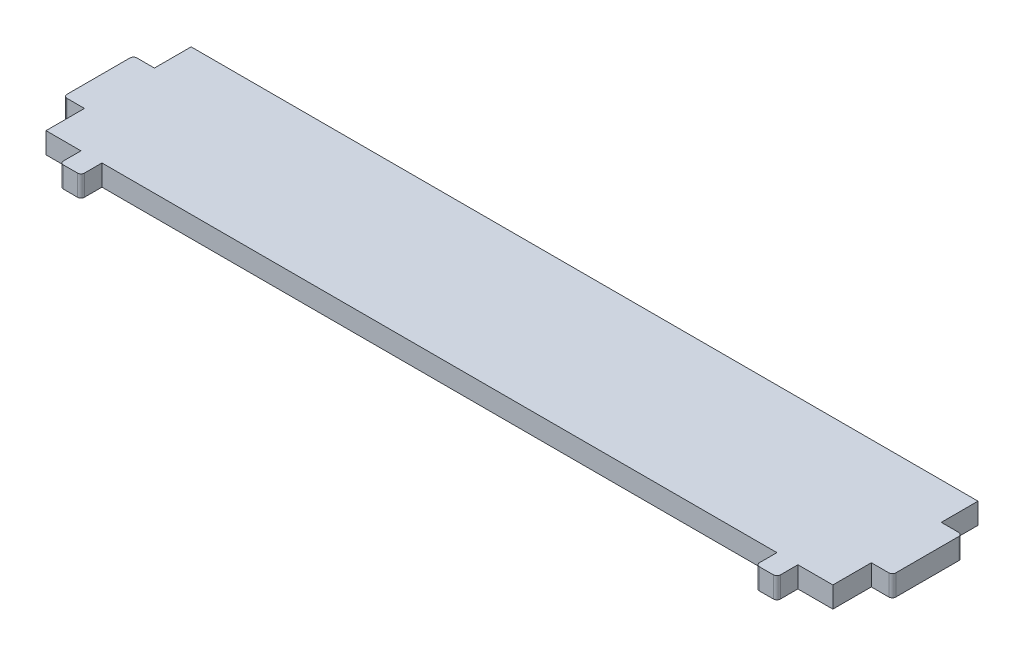
ISO-10303-21;
HEADER;
FILE_DESCRIPTION(('STEP AP214'),'2;1');
FILE_NAME('part.step','',(''),(''),'','','');
FILE_SCHEMA(('AUTOMOTIVE_DESIGN { 1 0 10303 214 1 1 1 1 }'));
ENDSEC;
DATA;
#1=APPLICATION_CONTEXT('core data for automotive mechanical design processes');
#2=APPLICATION_PROTOCOL_DEFINITION('international standard','automotive_design',2000,#1);
#3=PRODUCT_CONTEXT('',#1,'mechanical');
#4=PRODUCT('Part','Part','',(#3));
#5=PRODUCT_RELATED_PRODUCT_CATEGORY('part','',(#4));
#6=PRODUCT_DEFINITION_FORMATION('','',#4);
#7=PRODUCT_DEFINITION_CONTEXT('part definition',#1,'design');
#8=PRODUCT_DEFINITION('design','',#6,#7);
#9=PRODUCT_DEFINITION_SHAPE('','',#8);
#10=(LENGTH_UNIT() NAMED_UNIT(*) SI_UNIT(.MILLI.,.METRE.));
#11=(NAMED_UNIT(*) PLANE_ANGLE_UNIT() SI_UNIT($,.RADIAN.));
#12=(NAMED_UNIT(*) SI_UNIT($,.STERADIAN.) SOLID_ANGLE_UNIT());
#13=UNCERTAINTY_MEASURE_WITH_UNIT(LENGTH_MEASURE(1.E-05),#10,'distance_accuracy_value','');
#14=(GEOMETRIC_REPRESENTATION_CONTEXT(3) GLOBAL_UNCERTAINTY_ASSIGNED_CONTEXT((#13)) GLOBAL_UNIT_ASSIGNED_CONTEXT((#10,
#11,#12)) REPRESENTATION_CONTEXT('',''));
#15=CARTESIAN_POINT('',(0.,0.,0.));
#16=DIRECTION('',(0.,0.,1.));
#17=DIRECTION('',(1.,0.,0.));
#18=AXIS2_PLACEMENT_3D('',#15,#16,#17);
#19=CARTESIAN_POINT('',(-56.25,3.,0.));
#20=DIRECTION('',(-1.,0.,0.));
#21=DIRECTION('',(0.,0.,1.));
#22=AXIS2_PLACEMENT_3D('',#19,#20,#21);
#23=PLANE('',#22);
#24=DIRECTION('',(0.,0.,-1.));
#25=VECTOR('',#24,1.);
#26=CARTESIAN_POINT('',(-56.25,0.,0.));
#27=LINE('',#26,#25);
#28=CARTESIAN_POINT('',(-56.25,0.,20.75));
#29=VERTEX_POINT('',#28);
#30=CARTESIAN_POINT('',(-56.25,0.,15.25));
#31=VERTEX_POINT('',#30);
#32=EDGE_CURVE('E235',#29,#31,#27,.T.);
#33=ORIENTED_EDGE('',*,*,#32,.F.);
#34=DIRECTION('',(0.,-1.,0.));
#35=VECTOR('',#34,1.);
#36=CARTESIAN_POINT('',(-56.25,3.,20.75));
#37=LINE('',#36,#35);
#38=CARTESIAN_POINT('',(-56.25,3.,20.75));
#39=VERTEX_POINT('',#38);
#40=EDGE_CURVE('E230',#39,#29,#37,.T.);
#41=ORIENTED_EDGE('',*,*,#40,.F.);
#42=DIRECTION('',(0.,0.,-1.));
#43=VECTOR('',#42,1.);
#44=CARTESIAN_POINT('',(-56.25,3.,0.));
#45=LINE('',#44,#43);
#46=CARTESIAN_POINT('',(-56.25,3.,15.25));
#47=VERTEX_POINT('',#46);
#48=EDGE_CURVE('E233',#39,#47,#45,.T.);
#49=ORIENTED_EDGE('',*,*,#48,.T.);
#50=DIRECTION('',(0.,-1.,0.));
#51=VECTOR('',#50,1.);
#52=CARTESIAN_POINT('',(-56.25,3.,15.25));
#53=LINE('',#52,#51);
#54=EDGE_CURVE('E315',#47,#31,#53,.T.);
#55=ORIENTED_EDGE('',*,*,#54,.T.);
#56=EDGE_LOOP('',(#33,#41,#49,#55));
#57=FACE_BOUND('',#56,.T.);
#58=ADVANCED_FACE('F43',(#57),#23,.T.);
#59=CARTESIAN_POINT('',(0.,3.,20.75));
#60=DIRECTION('',(0.,0.,-1.));
#61=DIRECTION('',(-1.,0.,0.));
#62=AXIS2_PLACEMENT_3D('',#59,#60,#61);
#63=PLANE('',#62);
#64=DIRECTION('',(1.,0.,0.));
#65=VECTOR('',#64,1.);
#66=CARTESIAN_POINT('',(0.,0.,20.75));
#67=LINE('',#66,#65);
#68=CARTESIAN_POINT('',(-51.25,0.,20.75));
#69=VERTEX_POINT('',#68);
#70=EDGE_CURVE('E318',#29,#69,#67,.T.);
#71=ORIENTED_EDGE('',*,*,#70,.T.);
#72=DIRECTION('',(0.,-1.,0.));
#73=VECTOR('',#72,1.);
#74=CARTESIAN_POINT('',(-51.25,3.,20.75));
#75=LINE('',#74,#73);
#76=CARTESIAN_POINT('',(-51.25,3.,20.75));
#77=VERTEX_POINT('',#76);
#78=EDGE_CURVE('E241',#77,#69,#75,.T.);
#79=ORIENTED_EDGE('',*,*,#78,.F.);
#80=DIRECTION('',(1.,0.,0.));
#81=VECTOR('',#80,1.);
#82=CARTESIAN_POINT('',(0.,3.,20.75));
#83=LINE('',#82,#81);
#84=EDGE_CURVE('E245',#39,#77,#83,.T.);
#85=ORIENTED_EDGE('',*,*,#84,.F.);
#86=ORIENTED_EDGE('',*,*,#40,.T.);
#87=EDGE_LOOP('',(#71,#79,#85,#86));
#88=FACE_BOUND('',#87,.T.);
#89=ADVANCED_FACE('F246',(#88),#63,.F.);
#90=CARTESIAN_POINT('',(-51.25,3.,0.));
#91=DIRECTION('',(-1.,0.,0.));
#92=DIRECTION('',(0.,0.,1.));
#93=AXIS2_PLACEMENT_3D('',#90,#91,#92);
#94=PLANE('',#93);
#95=DIRECTION('',(0.,0.,-1.));
#96=VECTOR('',#95,1.);
#97=CARTESIAN_POINT('',(-51.25,0.,0.));
#98=LINE('',#97,#96);
#99=CARTESIAN_POINT('',(-51.25,0.,23.25));
#100=VERTEX_POINT('',#99);
#101=EDGE_CURVE('E321',#100,#69,#98,.T.);
#102=ORIENTED_EDGE('',*,*,#101,.F.);
#103=DIRECTION('',(0.,-1.,0.));
#104=VECTOR('',#103,1.);
#105=CARTESIAN_POINT('',(-51.25,3.,23.25));
#106=LINE('',#105,#104);
#107=CARTESIAN_POINT('',(-51.25,3.,23.25));
#108=VERTEX_POINT('',#107);
#109=EDGE_CURVE('E443',#100,#108,#106,.F.);
#110=ORIENTED_EDGE('',*,*,#109,.T.);
#111=DIRECTION('',(0.,0.,-1.));
#112=VECTOR('',#111,1.);
#113=CARTESIAN_POINT('',(-51.25,3.,0.));
#114=LINE('',#113,#112);
#115=EDGE_CURVE('E250',#108,#77,#114,.T.);
#116=ORIENTED_EDGE('',*,*,#115,.T.);
#117=ORIENTED_EDGE('',*,*,#78,.T.);
#118=EDGE_LOOP('',(#102,#110,#116,#117));
#119=FACE_BOUND('',#118,.T.);
#120=ADVANCED_FACE('F561',(#119),#94,.T.);
#121=CARTESIAN_POINT('',(0.,3.,23.75));
#122=DIRECTION('',(0.,0.,1.));
#123=DIRECTION('',(1.,0.,0.));
#124=AXIS2_PLACEMENT_3D('',#121,#122,#123);
#125=PLANE('',#124);
#126=DIRECTION('',(-1.,0.,0.));
#127=VECTOR('',#126,1.);
#128=CARTESIAN_POINT('',(0.,3.,23.75));
#129=LINE('',#128,#127);
#130=CARTESIAN_POINT('',(-48.75,3.,23.75));
#131=VERTEX_POINT('',#130);
#132=CARTESIAN_POINT('',(-50.75,3.,23.75));
#133=VERTEX_POINT('',#132);
#134=EDGE_CURVE('E266',#131,#133,#129,.T.);
#135=ORIENTED_EDGE('',*,*,#134,.T.);
#136=DIRECTION('',(0.,-1.,0.));
#137=VECTOR('',#136,1.);
#138=CARTESIAN_POINT('',(-50.75,3.,23.75));
#139=LINE('',#138,#137);
#140=CARTESIAN_POINT('',(-50.75,0.,23.75));
#141=VERTEX_POINT('',#140);
#142=EDGE_CURVE('E415',#133,#141,#139,.T.);
#143=ORIENTED_EDGE('',*,*,#142,.T.);
#144=DIRECTION('',(-1.,0.,0.));
#145=VECTOR('',#144,1.);
#146=CARTESIAN_POINT('',(0.,0.,23.75));
#147=LINE('',#146,#145);
#148=CARTESIAN_POINT('',(-48.75,0.,23.75));
#149=VERTEX_POINT('',#148);
#150=EDGE_CURVE('E326',#149,#141,#147,.T.);
#151=ORIENTED_EDGE('',*,*,#150,.F.);
#152=DIRECTION('',(0.,-1.,0.));
#153=VECTOR('',#152,1.);
#154=CARTESIAN_POINT('',(-48.75,3.,23.75));
#155=LINE('',#154,#153);
#156=EDGE_CURVE('E240',#149,#131,#155,.F.);
#157=ORIENTED_EDGE('',*,*,#156,.T.);
#158=EDGE_LOOP('',(#135,#143,#151,#157));
#159=FACE_BOUND('',#158,.T.);
#160=ADVANCED_FACE('F569',(#159),#125,.T.);
#161=CARTESIAN_POINT('',(-48.25,3.,0.));
#162=DIRECTION('',(-1.,0.,0.));
#163=DIRECTION('',(0.,0.,1.));
#164=AXIS2_PLACEMENT_3D('',#161,#162,#163);
#165=PLANE('',#164);
#166=DIRECTION('',(0.,0.,-1.));
#167=VECTOR('',#166,1.);
#168=CARTESIAN_POINT('',(-48.25,3.,0.));
#169=LINE('',#168,#167);
#170=CARTESIAN_POINT('',(-48.25,3.,23.25));
#171=VERTEX_POINT('',#170);
#172=CARTESIAN_POINT('',(-48.25,3.,20.75));
#173=VERTEX_POINT('',#172);
#174=EDGE_CURVE('E270',#171,#173,#169,.T.);
#175=ORIENTED_EDGE('',*,*,#174,.F.);
#176=DIRECTION('',(0.,-1.,0.));
#177=VECTOR('',#176,1.);
#178=CARTESIAN_POINT('',(-48.25,0.,23.25));
#179=LINE('',#178,#177);
#180=CARTESIAN_POINT('',(-48.25,0.,23.25));
#181=VERTEX_POINT('',#180);
#182=EDGE_CURVE('E468',#171,#181,#179,.T.);
#183=ORIENTED_EDGE('',*,*,#182,.T.);
#184=DIRECTION('',(0.,0.,-1.));
#185=VECTOR('',#184,1.);
#186=CARTESIAN_POINT('',(-48.25,0.,0.));
#187=LINE('',#186,#185);
#188=CARTESIAN_POINT('',(-48.25,0.,20.75));
#189=VERTEX_POINT('',#188);
#190=EDGE_CURVE('E330',#181,#189,#187,.T.);
#191=ORIENTED_EDGE('',*,*,#190,.T.);
#192=DIRECTION('',(0.,-1.,0.));
#193=VECTOR('',#192,1.);
#194=CARTESIAN_POINT('',(-48.25,3.,20.75));
#195=LINE('',#194,#193);
#196=EDGE_CURVE('E407',#173,#189,#195,.T.);
#197=ORIENTED_EDGE('',*,*,#196,.F.);
#198=EDGE_LOOP('',(#175,#183,#191,#197));
#199=FACE_BOUND('',#198,.T.);
#200=ADVANCED_FACE('F579',(#199),#165,.F.);
#201=CARTESIAN_POINT('',(48.25,0.,20.75));
#202=VERTEX_POINT('',#201);
#203=EDGE_CURVE('E323',#189,#202,#67,.T.);
#204=ORIENTED_EDGE('',*,*,#203,.T.);
#205=DIRECTION('',(0.,-1.,0.));
#206=VECTOR('',#205,1.);
#207=CARTESIAN_POINT('',(48.25,3.,20.75));
#208=LINE('',#207,#206);
#209=CARTESIAN_POINT('',(48.25,3.,20.75));
#210=VERTEX_POINT('',#209);
#211=EDGE_CURVE('E403',#210,#202,#208,.T.);
#212=ORIENTED_EDGE('',*,*,#211,.F.);
#213=EDGE_CURVE('E253',#173,#210,#83,.T.);
#214=ORIENTED_EDGE('',*,*,#213,.F.);
#215=ORIENTED_EDGE('',*,*,#196,.T.);
#216=EDGE_LOOP('',(#204,#212,#214,#215));
#217=FACE_BOUND('',#216,.T.);
#218=ADVANCED_FACE('F589',(#217),#63,.F.);
#219=CARTESIAN_POINT('',(48.25,3.,0.));
#220=DIRECTION('',(-1.,0.,0.));
#221=DIRECTION('',(0.,0.,1.));
#222=AXIS2_PLACEMENT_3D('',#219,#220,#221);
#223=PLANE('',#222);
#224=DIRECTION('',(0.,0.,-1.));
#225=VECTOR('',#224,1.);
#226=CARTESIAN_POINT('',(48.25,0.,0.));
#227=LINE('',#226,#225);
#228=CARTESIAN_POINT('',(48.25,0.,23.25));
#229=VERTEX_POINT('',#228);
#230=EDGE_CURVE('E333',#229,#202,#227,.T.);
#231=ORIENTED_EDGE('',*,*,#230,.F.);
#232=DIRECTION('',(0.,-1.,0.));
#233=VECTOR('',#232,1.);
#234=CARTESIAN_POINT('',(48.25,3.,23.25));
#235=LINE('',#234,#233);
#236=CARTESIAN_POINT('',(48.25,3.,23.25));
#237=VERTEX_POINT('',#236);
#238=EDGE_CURVE('E479',#229,#237,#235,.F.);
#239=ORIENTED_EDGE('',*,*,#238,.T.);
#240=DIRECTION('',(0.,0.,-1.));
#241=VECTOR('',#240,1.);
#242=CARTESIAN_POINT('',(48.25,3.,0.));
#243=LINE('',#242,#241);
#244=EDGE_CURVE('E273',#237,#210,#243,.T.);
#245=ORIENTED_EDGE('',*,*,#244,.T.);
#246=ORIENTED_EDGE('',*,*,#211,.T.);
#247=EDGE_LOOP('',(#231,#239,#245,#246));
#248=FACE_BOUND('',#247,.T.);
#249=ADVANCED_FACE('F592',(#248),#223,.T.);
#250=CARTESIAN_POINT('',(0.,3.,23.75));
#251=DIRECTION('',(0.,0.,-1.));
#252=DIRECTION('',(-1.,0.,0.));
#253=AXIS2_PLACEMENT_3D('',#250,#251,#252);
#254=PLANE('',#253);
#255=DIRECTION('',(1.,0.,0.));
#256=VECTOR('',#255,1.);
#257=CARTESIAN_POINT('',(0.,3.,23.75));
#258=LINE('',#257,#256);
#259=CARTESIAN_POINT('',(48.75,3.,23.75));
#260=VERTEX_POINT('',#259);
#261=CARTESIAN_POINT('',(50.75,3.,23.75));
#262=VERTEX_POINT('',#261);
#263=EDGE_CURVE('E276',#260,#262,#258,.T.);
#264=ORIENTED_EDGE('',*,*,#263,.F.);
#265=DIRECTION('',(0.,-1.,0.));
#266=VECTOR('',#265,1.);
#267=CARTESIAN_POINT('',(48.75,0.,23.75));
#268=LINE('',#267,#266);
#269=CARTESIAN_POINT('',(48.75,0.,23.75));
#270=VERTEX_POINT('',#269);
#271=EDGE_CURVE('E475',#260,#270,#268,.T.);
#272=ORIENTED_EDGE('',*,*,#271,.T.);
#273=DIRECTION('',(1.,0.,0.));
#274=VECTOR('',#273,1.);
#275=CARTESIAN_POINT('',(0.,0.,23.75));
#276=LINE('',#275,#274);
#277=CARTESIAN_POINT('',(50.75,0.,23.75));
#278=VERTEX_POINT('',#277);
#279=EDGE_CURVE('E336',#270,#278,#276,.T.);
#280=ORIENTED_EDGE('',*,*,#279,.T.);
#281=DIRECTION('',(0.,-1.,0.));
#282=VECTOR('',#281,1.);
#283=CARTESIAN_POINT('',(50.75,3.,23.75));
#284=LINE('',#283,#282);
#285=EDGE_CURVE('E472',#278,#262,#284,.F.);
#286=ORIENTED_EDGE('',*,*,#285,.T.);
#287=EDGE_LOOP('',(#264,#272,#280,#286));
#288=FACE_BOUND('',#287,.T.);
#289=ADVANCED_FACE('F600',(#288),#254,.F.);
#290=CARTESIAN_POINT('',(51.25,3.,0.));
#291=DIRECTION('',(-1.,0.,0.));
#292=DIRECTION('',(0.,0.,1.));
#293=AXIS2_PLACEMENT_3D('',#290,#291,#292);
#294=PLANE('',#293);
#295=DIRECTION('',(0.,0.,-1.));
#296=VECTOR('',#295,1.);
#297=CARTESIAN_POINT('',(51.25,3.,0.));
#298=LINE('',#297,#296);
#299=CARTESIAN_POINT('',(51.25,3.,23.25));
#300=VERTEX_POINT('',#299);
#301=CARTESIAN_POINT('',(51.25,3.,20.75));
#302=VERTEX_POINT('',#301);
#303=EDGE_CURVE('E280',#300,#302,#298,.T.);
#304=ORIENTED_EDGE('',*,*,#303,.F.);
#305=DIRECTION('',(0.,-1.,0.));
#306=VECTOR('',#305,1.);
#307=CARTESIAN_POINT('',(51.25,3.,23.25));
#308=LINE('',#307,#306);
#309=CARTESIAN_POINT('',(51.25,0.,23.25));
#310=VERTEX_POINT('',#309);
#311=EDGE_CURVE('E482',#300,#310,#308,.T.);
#312=ORIENTED_EDGE('',*,*,#311,.T.);
#313=DIRECTION('',(0.,0.,-1.));
#314=VECTOR('',#313,1.);
#315=CARTESIAN_POINT('',(51.25,0.,0.));
#316=LINE('',#315,#314);
#317=CARTESIAN_POINT('',(51.25,0.,20.75));
#318=VERTEX_POINT('',#317);
#319=EDGE_CURVE('E340',#310,#318,#316,.T.);
#320=ORIENTED_EDGE('',*,*,#319,.T.);
#321=DIRECTION('',(0.,-1.,0.));
#322=VECTOR('',#321,1.);
#323=CARTESIAN_POINT('',(51.25,3.,20.75));
#324=LINE('',#323,#322);
#325=EDGE_CURVE('E399',#302,#318,#324,.T.);
#326=ORIENTED_EDGE('',*,*,#325,.F.);
#327=EDGE_LOOP('',(#304,#312,#320,#326));
#328=FACE_BOUND('',#327,.T.);
#329=ADVANCED_FACE('F609',(#328),#294,.F.);
#330=CARTESIAN_POINT('',(56.25,0.,20.75));
#331=VERTEX_POINT('',#330);
#332=EDGE_CURVE('E322',#318,#331,#67,.T.);
#333=ORIENTED_EDGE('',*,*,#332,.T.);
#334=DIRECTION('',(0.,-1.,0.));
#335=VECTOR('',#334,1.);
#336=CARTESIAN_POINT('',(56.25,3.,20.75));
#337=LINE('',#336,#335);
#338=CARTESIAN_POINT('',(56.25,3.,20.75));
#339=VERTEX_POINT('',#338);
#340=EDGE_CURVE('E395',#339,#331,#337,.T.);
#341=ORIENTED_EDGE('',*,*,#340,.F.);
#342=EDGE_CURVE('E252',#302,#339,#83,.T.);
#343=ORIENTED_EDGE('',*,*,#342,.F.);
#344=ORIENTED_EDGE('',*,*,#325,.T.);
#345=EDGE_LOOP('',(#333,#341,#343,#344));
#346=FACE_BOUND('',#345,.T.);
#347=ADVANCED_FACE('F615',(#346),#63,.F.);
#348=CARTESIAN_POINT('',(56.25,3.,0.));
#349=DIRECTION('',(-1.,0.,0.));
#350=DIRECTION('',(0.,0.,1.));
#351=AXIS2_PLACEMENT_3D('',#348,#349,#350);
#352=PLANE('',#351);
#353=DIRECTION('',(0.,0.,-1.));
#354=VECTOR('',#353,1.);
#355=CARTESIAN_POINT('',(56.25,0.,0.));
#356=LINE('',#355,#354);
#357=CARTESIAN_POINT('',(56.25,0.,15.25));
#358=VERTEX_POINT('',#357);
#359=EDGE_CURVE('E343',#331,#358,#356,.T.);
#360=ORIENTED_EDGE('',*,*,#359,.T.);
#361=DIRECTION('',(0.,-1.,0.));
#362=VECTOR('',#361,1.);
#363=CARTESIAN_POINT('',(56.25,3.,15.25));
#364=LINE('',#363,#362);
#365=CARTESIAN_POINT('',(56.25,3.,15.25));
#366=VERTEX_POINT('',#365);
#367=EDGE_CURVE('E391',#366,#358,#364,.T.);
#368=ORIENTED_EDGE('',*,*,#367,.F.);
#369=DIRECTION('',(0.,0.,-1.));
#370=VECTOR('',#369,1.);
#371=CARTESIAN_POINT('',(56.25,3.,0.));
#372=LINE('',#371,#370);
#373=EDGE_CURVE('E283',#339,#366,#372,.T.);
#374=ORIENTED_EDGE('',*,*,#373,.F.);
#375=ORIENTED_EDGE('',*,*,#340,.T.);
#376=EDGE_LOOP('',(#360,#368,#374,#375));
#377=FACE_BOUND('',#376,.T.);
#378=ADVANCED_FACE('F621',(#377),#352,.F.);
#379=CARTESIAN_POINT('',(0.,3.,15.25));
#380=DIRECTION('',(0.,0.,-1.));
#381=DIRECTION('',(-1.,0.,0.));
#382=AXIS2_PLACEMENT_3D('',#379,#380,#381);
#383=PLANE('',#382);
#384=DIRECTION('',(1.,0.,0.));
#385=VECTOR('',#384,1.);
#386=CARTESIAN_POINT('',(0.,0.,15.25));
#387=LINE('',#386,#385);
#388=CARTESIAN_POINT('',(58.75,0.,15.25));
#389=VERTEX_POINT('',#388);
#390=EDGE_CURVE('E346',#358,#389,#387,.T.);
#391=ORIENTED_EDGE('',*,*,#390,.T.);
#392=DIRECTION('',(0.,-1.,0.));
#393=VECTOR('',#392,1.);
#394=CARTESIAN_POINT('',(58.75,3.,15.25));
#395=LINE('',#394,#393);
#396=CARTESIAN_POINT('',(58.75,3.,15.25));
#397=VERTEX_POINT('',#396);
#398=EDGE_CURVE('E11',#389,#397,#395,.F.);
#399=ORIENTED_EDGE('',*,*,#398,.T.);
#400=DIRECTION('',(1.,0.,0.));
#401=VECTOR('',#400,1.);
#402=CARTESIAN_POINT('',(0.,3.,15.25));
#403=LINE('',#402,#401);
#404=EDGE_CURVE('E286',#366,#397,#403,.T.);
#405=ORIENTED_EDGE('',*,*,#404,.F.);
#406=ORIENTED_EDGE('',*,*,#367,.T.);
#407=EDGE_LOOP('',(#391,#399,#405,#406));
#408=FACE_BOUND('',#407,.T.);
#409=ADVANCED_FACE('F625',(#408),#383,.F.);
#410=CARTESIAN_POINT('',(59.25,3.,0.));
#411=DIRECTION('',(-1.,0.,0.));
#412=DIRECTION('',(0.,0.,1.));
#413=AXIS2_PLACEMENT_3D('',#410,#411,#412);
#414=PLANE('',#413);
#415=DIRECTION('',(0.,0.,-1.));
#416=VECTOR('',#415,1.);
#417=CARTESIAN_POINT('',(59.25,0.,0.));
#418=LINE('',#417,#416);
#419=CARTESIAN_POINT('',(59.25,0.,14.75));
#420=VERTEX_POINT('',#419);
#421=CARTESIAN_POINT('',(59.25,0.,5.75000000000001));
#422=VERTEX_POINT('',#421);
#423=EDGE_CURVE('E350',#420,#422,#418,.T.);
#424=ORIENTED_EDGE('',*,*,#423,.T.);
#425=DIRECTION('',(0.,-1.,0.));
#426=VECTOR('',#425,1.);
#427=CARTESIAN_POINT('',(59.25,3.,5.75000000000001));
#428=LINE('',#427,#426);
#429=CARTESIAN_POINT('',(59.25,3.,5.75000000000001));
#430=VERTEX_POINT('',#429);
#431=EDGE_CURVE('E52',#422,#430,#428,.F.);
#432=ORIENTED_EDGE('',*,*,#431,.T.);
#433=DIRECTION('',(0.,0.,-1.));
#434=VECTOR('',#433,1.);
#435=CARTESIAN_POINT('',(59.25,3.,0.));
#436=LINE('',#435,#434);
#437=CARTESIAN_POINT('',(59.25,3.,14.75));
#438=VERTEX_POINT('',#437);
#439=EDGE_CURVE('E290',#438,#430,#436,.T.);
#440=ORIENTED_EDGE('',*,*,#439,.F.);
#441=DIRECTION('',(0.,-1.,0.));
#442=VECTOR('',#441,1.);
#443=CARTESIAN_POINT('',(59.25,3.,14.75));
#444=LINE('',#443,#442);
#445=EDGE_CURVE('E504',#438,#420,#444,.T.);
#446=ORIENTED_EDGE('',*,*,#445,.T.);
#447=EDGE_LOOP('',(#424,#432,#440,#446));
#448=FACE_BOUND('',#447,.T.);
#449=ADVANCED_FACE('F511',(#448),#414,.F.);
#450=CARTESIAN_POINT('',(0.,3.,5.25000000000003));
#451=DIRECTION('',(0.,0.,1.));
#452=DIRECTION('',(1.,0.,0.));
#453=AXIS2_PLACEMENT_3D('',#450,#451,#452);
#454=PLANE('',#453);
#455=DIRECTION('',(-1.,0.,0.));
#456=VECTOR('',#455,1.);
#457=CARTESIAN_POINT('',(0.,3.,5.25000000000003));
#458=LINE('',#457,#456);
#459=CARTESIAN_POINT('',(58.75,3.,5.25000000000001));
#460=VERTEX_POINT('',#459);
#461=CARTESIAN_POINT('',(56.25,3.,5.25000000000002));
#462=VERTEX_POINT('',#461);
#463=EDGE_CURVE('E294',#460,#462,#458,.T.);
#464=ORIENTED_EDGE('',*,*,#463,.F.);
#465=DIRECTION('',(0.,-1.,0.));
#466=VECTOR('',#465,1.);
#467=CARTESIAN_POINT('',(58.75,3.,5.25000000000001));
#468=LINE('',#467,#466);
#469=CARTESIAN_POINT('',(58.75,0.,5.25000000000001));
#470=VERTEX_POINT('',#469);
#471=EDGE_CURVE('E500',#460,#470,#468,.T.);
#472=ORIENTED_EDGE('',*,*,#471,.T.);
#473=DIRECTION('',(-1.,0.,0.));
#474=VECTOR('',#473,1.);
#475=CARTESIAN_POINT('',(0.,0.,5.25000000000003));
#476=LINE('',#475,#474);
#477=CARTESIAN_POINT('',(56.25,0.,5.25000000000002));
#478=VERTEX_POINT('',#477);
#479=EDGE_CURVE('E354',#470,#478,#476,.T.);
#480=ORIENTED_EDGE('',*,*,#479,.T.);
#481=DIRECTION('',(0.,-1.,0.));
#482=VECTOR('',#481,1.);
#483=CARTESIAN_POINT('',(56.25,3.,5.25000000000002));
#484=LINE('',#483,#482);
#485=EDGE_CURVE('E387',#462,#478,#484,.T.);
#486=ORIENTED_EDGE('',*,*,#485,.F.);
#487=EDGE_LOOP('',(#464,#472,#480,#486));
#488=FACE_BOUND('',#487,.T.);
#489=ADVANCED_FACE('F522',(#488),#454,.F.);
#490=CARTESIAN_POINT('',(56.25,3.,0.));
#491=DIRECTION('',(-1.,0.,0.));
#492=DIRECTION('',(0.,0.,1.));
#493=AXIS2_PLACEMENT_3D('',#490,#491,#492);
#494=PLANE('',#493);
#495=DIRECTION('',(0.,0.,-1.));
#496=VECTOR('',#495,1.);
#497=CARTESIAN_POINT('',(56.25,0.,0.));
#498=LINE('',#497,#496);
#499=CARTESIAN_POINT('',(56.25,0.,0.));
#500=VERTEX_POINT('',#499);
#501=EDGE_CURVE('E357',#478,#500,#498,.T.);
#502=ORIENTED_EDGE('',*,*,#501,.T.);
#503=DIRECTION('',(0.,-1.,0.));
#504=VECTOR('',#503,1.);
#505=CARTESIAN_POINT('',(56.25,3.,0.));
#506=LINE('',#505,#504);
#507=CARTESIAN_POINT('',(56.25,3.,0.));
#508=VERTEX_POINT('',#507);
#509=EDGE_CURVE('E383',#508,#500,#506,.T.);
#510=ORIENTED_EDGE('',*,*,#509,.F.);
#511=DIRECTION('',(0.,0.,-1.));
#512=VECTOR('',#511,1.);
#513=CARTESIAN_POINT('',(56.25,3.,0.));
#514=LINE('',#513,#512);
#515=EDGE_CURVE('E297',#462,#508,#514,.T.);
#516=ORIENTED_EDGE('',*,*,#515,.F.);
#517=ORIENTED_EDGE('',*,*,#485,.T.);
#518=EDGE_LOOP('',(#502,#510,#516,#517));
#519=FACE_BOUND('',#518,.T.);
#520=ADVANCED_FACE('F530',(#519),#494,.F.);
#521=CARTESIAN_POINT('',(0.,3.,0.));
#522=DIRECTION('',(0.,0.,1.));
#523=DIRECTION('',(1.,0.,0.));
#524=AXIS2_PLACEMENT_3D('',#521,#522,#523);
#525=PLANE('',#524);
#526=DIRECTION('',(-1.,0.,0.));
#527=VECTOR('',#526,1.);
#528=CARTESIAN_POINT('',(0.,0.,0.));
#529=LINE('',#528,#527);
#530=CARTESIAN_POINT('',(-56.25,0.,0.));
#531=VERTEX_POINT('',#530);
#532=EDGE_CURVE('E360',#500,#531,#529,.T.);
#533=ORIENTED_EDGE('',*,*,#532,.T.);
#534=DIRECTION('',(0.,-1.,0.));
#535=VECTOR('',#534,1.);
#536=CARTESIAN_POINT('',(-56.25,3.,0.));
#537=LINE('',#536,#535);
#538=CARTESIAN_POINT('',(-56.25,3.,0.));
#539=VERTEX_POINT('',#538);
#540=EDGE_CURVE('E380',#539,#531,#537,.T.);
#541=ORIENTED_EDGE('',*,*,#540,.F.);
#542=DIRECTION('',(-1.,0.,0.));
#543=VECTOR('',#542,1.);
#544=CARTESIAN_POINT('',(0.,3.,0.));
#545=LINE('',#544,#543);
#546=EDGE_CURVE('E300',#508,#539,#545,.T.);
#547=ORIENTED_EDGE('',*,*,#546,.F.);
#548=ORIENTED_EDGE('',*,*,#509,.T.);
#549=EDGE_LOOP('',(#533,#541,#547,#548));
#550=FACE_BOUND('',#549,.T.);
#551=ADVANCED_FACE('F534',(#550),#525,.F.);
#552=CARTESIAN_POINT('',(-56.25,3.,0.));
#553=DIRECTION('',(-1.,0.,0.));
#554=DIRECTION('',(0.,0.,1.));
#555=AXIS2_PLACEMENT_3D('',#552,#553,#554);
#556=PLANE('',#555);
#557=DIRECTION('',(0.,0.,-1.));
#558=VECTOR('',#557,1.);
#559=CARTESIAN_POINT('',(-56.25,0.,0.));
#560=LINE('',#559,#558);
#561=CARTESIAN_POINT('',(-56.25,0.,5.25000000000002));
#562=VERTEX_POINT('',#561);
#563=EDGE_CURVE('E364',#562,#531,#560,.T.);
#564=ORIENTED_EDGE('',*,*,#563,.F.);
#565=DIRECTION('',(0.,-1.,0.));
#566=VECTOR('',#565,1.);
#567=CARTESIAN_POINT('',(-56.25,3.,5.25000000000002));
#568=LINE('',#567,#566);
#569=CARTESIAN_POINT('',(-56.25,3.,5.25000000000002));
#570=VERTEX_POINT('',#569);
#571=EDGE_CURVE('E376',#570,#562,#568,.T.);
#572=ORIENTED_EDGE('',*,*,#571,.F.);
#573=DIRECTION('',(0.,0.,-1.));
#574=VECTOR('',#573,1.);
#575=CARTESIAN_POINT('',(-56.25,3.,0.));
#576=LINE('',#575,#574);
#577=EDGE_CURVE('E303',#570,#539,#576,.T.);
#578=ORIENTED_EDGE('',*,*,#577,.T.);
#579=ORIENTED_EDGE('',*,*,#540,.T.);
#580=EDGE_LOOP('',(#564,#572,#578,#579));
#581=FACE_BOUND('',#580,.T.);
#582=ADVANCED_FACE('F540',(#581),#556,.T.);
#583=CARTESIAN_POINT('',(0.,3.,5.25000000000003));
#584=DIRECTION('',(0.,0.,-1.));
#585=DIRECTION('',(-1.,0.,0.));
#586=AXIS2_PLACEMENT_3D('',#583,#584,#585);
#587=PLANE('',#586);
#588=DIRECTION('',(1.,0.,0.));
#589=VECTOR('',#588,1.);
#590=CARTESIAN_POINT('',(0.,0.,5.25000000000003));
#591=LINE('',#590,#589);
#592=CARTESIAN_POINT('',(-58.75,0.,5.25000000000001));
#593=VERTEX_POINT('',#592);
#594=EDGE_CURVE('E368',#593,#562,#591,.T.);
#595=ORIENTED_EDGE('',*,*,#594,.F.);
#596=DIRECTION('',(0.,-1.,0.));
#597=VECTOR('',#596,1.);
#598=CARTESIAN_POINT('',(-58.75,3.,5.25000000000001));
#599=LINE('',#598,#597);
#600=CARTESIAN_POINT('',(-58.75,3.,5.25000000000001));
#601=VERTEX_POINT('',#600);
#602=EDGE_CURVE('E493',#593,#601,#599,.F.);
#603=ORIENTED_EDGE('',*,*,#602,.T.);
#604=DIRECTION('',(1.,0.,0.));
#605=VECTOR('',#604,1.);
#606=CARTESIAN_POINT('',(0.,3.,5.25000000000003));
#607=LINE('',#606,#605);
#608=EDGE_CURVE('E307',#601,#570,#607,.T.);
#609=ORIENTED_EDGE('',*,*,#608,.T.);
#610=ORIENTED_EDGE('',*,*,#571,.T.);
#611=EDGE_LOOP('',(#595,#603,#609,#610));
#612=FACE_BOUND('',#611,.T.);
#613=ADVANCED_FACE('F543',(#612),#587,.T.);
#614=CARTESIAN_POINT('',(-59.25,3.,0.));
#615=DIRECTION('',(-1.,0.,0.));
#616=DIRECTION('',(0.,0.,1.));
#617=AXIS2_PLACEMENT_3D('',#614,#615,#616);
#618=PLANE('',#617);
#619=DIRECTION('',(0.,0.,-1.));
#620=VECTOR('',#619,1.);
#621=CARTESIAN_POINT('',(-59.25,3.,0.));
#622=LINE('',#621,#620);
#623=CARTESIAN_POINT('',(-59.25,3.,14.75));
#624=VERTEX_POINT('',#623);
#625=CARTESIAN_POINT('',(-59.25,3.,5.75000000000001));
#626=VERTEX_POINT('',#625);
#627=EDGE_CURVE('E310',#624,#626,#622,.T.);
#628=ORIENTED_EDGE('',*,*,#627,.T.);
#629=DIRECTION('',(0.,-1.,0.));
#630=VECTOR('',#629,1.);
#631=CARTESIAN_POINT('',(-59.25,3.,5.75000000000001));
#632=LINE('',#631,#630);
#633=CARTESIAN_POINT('',(-59.25,0.,5.75000000000001));
#634=VERTEX_POINT('',#633);
#635=EDGE_CURVE('E489',#626,#634,#632,.T.);
#636=ORIENTED_EDGE('',*,*,#635,.T.);
#637=DIRECTION('',(0.,0.,-1.));
#638=VECTOR('',#637,1.);
#639=CARTESIAN_POINT('',(-59.25,0.,0.));
#640=LINE('',#639,#638);
#641=CARTESIAN_POINT('',(-59.25,0.,14.75));
#642=VERTEX_POINT('',#641);
#643=EDGE_CURVE('E261',#642,#634,#640,.T.);
#644=ORIENTED_EDGE('',*,*,#643,.F.);
#645=DIRECTION('',(0.,-1.,0.));
#646=VECTOR('',#645,1.);
#647=CARTESIAN_POINT('',(-59.25,3.,14.75));
#648=LINE('',#647,#646);
#649=EDGE_CURVE('E486',#642,#624,#648,.F.);
#650=ORIENTED_EDGE('',*,*,#649,.T.);
#651=EDGE_LOOP('',(#628,#636,#644,#650));
#652=FACE_BOUND('',#651,.T.);
#653=ADVANCED_FACE('F550',(#652),#618,.T.);
#654=CARTESIAN_POINT('',(0.,3.,15.25));
#655=DIRECTION('',(0.,0.,1.));
#656=DIRECTION('',(1.,0.,0.));
#657=AXIS2_PLACEMENT_3D('',#654,#655,#656);
#658=PLANE('',#657);
#659=DIRECTION('',(-1.,0.,0.));
#660=VECTOR('',#659,1.);
#661=CARTESIAN_POINT('',(0.,3.,15.25));
#662=LINE('',#661,#660);
#663=CARTESIAN_POINT('',(-58.75,3.,15.25));
#664=VERTEX_POINT('',#663);
#665=EDGE_CURVE('E255',#47,#664,#662,.T.);
#666=ORIENTED_EDGE('',*,*,#665,.T.);
#667=DIRECTION('',(0.,-1.,0.));
#668=VECTOR('',#667,1.);
#669=CARTESIAN_POINT('',(-58.75,3.,15.25));
#670=LINE('',#669,#668);
#671=CARTESIAN_POINT('',(-58.75,0.,15.25));
#672=VERTEX_POINT('',#671);
#673=EDGE_CURVE('E496',#664,#672,#670,.T.);
#674=ORIENTED_EDGE('',*,*,#673,.T.);
#675=DIRECTION('',(-1.,0.,0.));
#676=VECTOR('',#675,1.);
#677=CARTESIAN_POINT('',(0.,0.,15.25));
#678=LINE('',#677,#676);
#679=EDGE_CURVE('E257',#31,#672,#678,.T.);
#680=ORIENTED_EDGE('',*,*,#679,.F.);
#681=ORIENTED_EDGE('',*,*,#54,.F.);
#682=EDGE_LOOP('',(#666,#674,#680,#681));
#683=FACE_BOUND('',#682,.T.);
#684=ADVANCED_FACE('F557',(#683),#658,.T.);
#685=CARTESIAN_POINT('',(0.,3.,0.));
#686=DIRECTION('',(0.,1.,0.));
#687=DIRECTION('',(0.,0.,1.));
#688=AXIS2_PLACEMENT_3D('',#685,#686,#687);
#689=PLANE('',#688);
#690=ORIENTED_EDGE('',*,*,#115,.F.);
#691=CARTESIAN_POINT('',(-50.75,3.,23.25));
#692=DIRECTION('',(0.,1.,0.));
#693=DIRECTION('',(0.,0.,1.));
#694=AXIS2_PLACEMENT_3D('',#691,#692,#693);
#695=CIRCLE('',#694,0.5);
#696=EDGE_CURVE('E465',#108,#133,#695,.T.);
#697=ORIENTED_EDGE('',*,*,#696,.T.);
#698=ORIENTED_EDGE('',*,*,#134,.F.);
#699=CARTESIAN_POINT('',(-48.75,3.,23.25));
#700=DIRECTION('',(0.,1.,0.));
#701=DIRECTION('',(0.,0.,1.));
#702=AXIS2_PLACEMENT_3D('',#699,#700,#701);
#703=CIRCLE('',#702,0.5);
#704=EDGE_CURVE('E462',#131,#171,#703,.T.);
#705=ORIENTED_EDGE('',*,*,#704,.T.);
#706=ORIENTED_EDGE('',*,*,#174,.T.);
#707=ORIENTED_EDGE('',*,*,#213,.T.);
#708=ORIENTED_EDGE('',*,*,#244,.F.);
#709=CARTESIAN_POINT('',(48.75,3.,23.25));
#710=DIRECTION('',(0.,1.,0.));
#711=DIRECTION('',(0.,0.,1.));
#712=AXIS2_PLACEMENT_3D('',#709,#710,#711);
#713=CIRCLE('',#712,0.5);
#714=EDGE_CURVE('E459',#237,#260,#713,.T.);
#715=ORIENTED_EDGE('',*,*,#714,.T.);
#716=ORIENTED_EDGE('',*,*,#263,.T.);
#717=CARTESIAN_POINT('',(50.75,3.,23.25));
#718=DIRECTION('',(0.,1.,0.));
#719=DIRECTION('',(0.,0.,1.));
#720=AXIS2_PLACEMENT_3D('',#717,#718,#719);
#721=CIRCLE('',#720,0.5);
#722=EDGE_CURVE('E456',#262,#300,#721,.T.);
#723=ORIENTED_EDGE('',*,*,#722,.T.);
#724=ORIENTED_EDGE('',*,*,#303,.T.);
#725=ORIENTED_EDGE('',*,*,#342,.T.);
#726=ORIENTED_EDGE('',*,*,#373,.T.);
#727=ORIENTED_EDGE('',*,*,#404,.T.);
#728=CARTESIAN_POINT('',(58.75,3.,14.75));
#729=DIRECTION('',(0.,1.,0.));
#730=DIRECTION('',(0.,0.,1.));
#731=AXIS2_PLACEMENT_3D('',#728,#729,#730);
#732=CIRCLE('',#731,0.5);
#733=EDGE_CURVE('E446',#397,#438,#732,.T.);
#734=ORIENTED_EDGE('',*,*,#733,.T.);
#735=ORIENTED_EDGE('',*,*,#439,.T.);
#736=CARTESIAN_POINT('',(58.75,3.,5.75000000000001));
#737=DIRECTION('',(0.,1.,0.));
#738=DIRECTION('',(0.,0.,1.));
#739=AXIS2_PLACEMENT_3D('',#736,#737,#738);
#740=CIRCLE('',#739,0.5);
#741=EDGE_CURVE('E449',#430,#460,#740,.T.);
#742=ORIENTED_EDGE('',*,*,#741,.T.);
#743=ORIENTED_EDGE('',*,*,#463,.T.);
#744=ORIENTED_EDGE('',*,*,#515,.T.);
#745=ORIENTED_EDGE('',*,*,#546,.T.);
#746=ORIENTED_EDGE('',*,*,#577,.F.);
#747=ORIENTED_EDGE('',*,*,#608,.F.);
#748=CARTESIAN_POINT('',(-58.75,3.,5.75000000000001));
#749=DIRECTION('',(0.,1.,0.));
#750=DIRECTION('',(0.,0.,1.));
#751=AXIS2_PLACEMENT_3D('',#748,#749,#750);
#752=CIRCLE('',#751,0.5);
#753=EDGE_CURVE('E65',#601,#626,#752,.T.);
#754=ORIENTED_EDGE('',*,*,#753,.T.);
#755=ORIENTED_EDGE('',*,*,#627,.F.);
#756=CARTESIAN_POINT('',(-58.75,3.,14.75));
#757=DIRECTION('',(0.,1.,0.));
#758=DIRECTION('',(0.,0.,1.));
#759=AXIS2_PLACEMENT_3D('',#756,#757,#758);
#760=CIRCLE('',#759,0.5);
#761=EDGE_CURVE('E59',#624,#664,#760,.T.);
#762=ORIENTED_EDGE('',*,*,#761,.T.);
#763=ORIENTED_EDGE('',*,*,#665,.F.);
#764=ORIENTED_EDGE('',*,*,#48,.F.);
#765=ORIENTED_EDGE('',*,*,#84,.T.);
#766=EDGE_LOOP('',(#690,#697,#698,#705,#706,#707,#708,#715,#716,#723,#724,#725,#726,#727,#734,
#735,#742,#743,#744,#745,#746,#747,#754,#755,#762,#763,#764,#765));
#767=FACE_BOUND('',#766,.T.);
#768=ADVANCED_FACE('F254',(#767),#689,.T.);
#769=CARTESIAN_POINT('',(0.,0.,0.));
#770=DIRECTION('',(0.,1.,0.));
#771=DIRECTION('',(0.,0.,1.));
#772=AXIS2_PLACEMENT_3D('',#769,#770,#771);
#773=PLANE('',#772);
#774=ORIENTED_EDGE('',*,*,#150,.T.);
#775=CARTESIAN_POINT('',(-50.75,0.,23.25));
#776=DIRECTION('',(0.,1.,0.));
#777=DIRECTION('',(0.,0.,1.));
#778=AXIS2_PLACEMENT_3D('',#775,#776,#777);
#779=CIRCLE('',#778,0.5);
#780=EDGE_CURVE('E440',#141,#100,#779,.F.);
#781=ORIENTED_EDGE('',*,*,#780,.T.);
#782=ORIENTED_EDGE('',*,*,#101,.T.);
#783=ORIENTED_EDGE('',*,*,#70,.F.);
#784=ORIENTED_EDGE('',*,*,#32,.T.);
#785=ORIENTED_EDGE('',*,*,#679,.T.);
#786=CARTESIAN_POINT('',(-58.75,0.,14.75));
#787=DIRECTION('',(0.,1.,0.));
#788=DIRECTION('',(0.,0.,1.));
#789=AXIS2_PLACEMENT_3D('',#786,#787,#788);
#790=CIRCLE('',#789,0.5);
#791=EDGE_CURVE('E425',#672,#642,#790,.F.);
#792=ORIENTED_EDGE('',*,*,#791,.T.);
#793=ORIENTED_EDGE('',*,*,#643,.T.);
#794=CARTESIAN_POINT('',(-58.75,0.,5.75000000000001));
#795=DIRECTION('',(0.,1.,0.));
#796=DIRECTION('',(0.,0.,1.));
#797=AXIS2_PLACEMENT_3D('',#794,#795,#796);
#798=CIRCLE('',#797,0.5);
#799=EDGE_CURVE('E428',#634,#593,#798,.F.);
#800=ORIENTED_EDGE('',*,*,#799,.T.);
#801=ORIENTED_EDGE('',*,*,#594,.T.);
#802=ORIENTED_EDGE('',*,*,#563,.T.);
#803=ORIENTED_EDGE('',*,*,#532,.F.);
#804=ORIENTED_EDGE('',*,*,#501,.F.);
#805=ORIENTED_EDGE('',*,*,#479,.F.);
#806=CARTESIAN_POINT('',(58.75,0.,5.75000000000001));
#807=DIRECTION('',(0.,1.,0.));
#808=DIRECTION('',(0.,0.,1.));
#809=AXIS2_PLACEMENT_3D('',#806,#807,#808);
#810=CIRCLE('',#809,0.5);
#811=EDGE_CURVE('E422',#470,#422,#810,.F.);
#812=ORIENTED_EDGE('',*,*,#811,.T.);
#813=ORIENTED_EDGE('',*,*,#423,.F.);
#814=CARTESIAN_POINT('',(58.75,0.,14.75));
#815=DIRECTION('',(0.,1.,0.));
#816=DIRECTION('',(0.,0.,1.));
#817=AXIS2_PLACEMENT_3D('',#814,#815,#816);
#818=CIRCLE('',#817,0.5);
#819=EDGE_CURVE('E419',#420,#389,#818,.F.);
#820=ORIENTED_EDGE('',*,*,#819,.T.);
#821=ORIENTED_EDGE('',*,*,#390,.F.);
#822=ORIENTED_EDGE('',*,*,#359,.F.);
#823=ORIENTED_EDGE('',*,*,#332,.F.);
#824=ORIENTED_EDGE('',*,*,#319,.F.);
#825=CARTESIAN_POINT('',(50.75,0.,23.25));
#826=DIRECTION('',(0.,1.,0.));
#827=DIRECTION('',(0.,0.,1.));
#828=AXIS2_PLACEMENT_3D('',#825,#826,#827);
#829=CIRCLE('',#828,0.5);
#830=EDGE_CURVE('E431',#310,#278,#829,.F.);
#831=ORIENTED_EDGE('',*,*,#830,.T.);
#832=ORIENTED_EDGE('',*,*,#279,.F.);
#833=CARTESIAN_POINT('',(48.75,0.,23.25));
#834=DIRECTION('',(0.,1.,0.));
#835=DIRECTION('',(0.,0.,1.));
#836=AXIS2_PLACEMENT_3D('',#833,#834,#835);
#837=CIRCLE('',#836,0.5);
#838=EDGE_CURVE('E434',#270,#229,#837,.F.);
#839=ORIENTED_EDGE('',*,*,#838,.T.);
#840=ORIENTED_EDGE('',*,*,#230,.T.);
#841=ORIENTED_EDGE('',*,*,#203,.F.);
#842=ORIENTED_EDGE('',*,*,#190,.F.);
#843=CARTESIAN_POINT('',(-48.75,0.,23.25));
#844=DIRECTION('',(0.,1.,0.));
#845=DIRECTION('',(0.,0.,1.));
#846=AXIS2_PLACEMENT_3D('',#843,#844,#845);
#847=CIRCLE('',#846,0.5);
#848=EDGE_CURVE('E437',#181,#149,#847,.F.);
#849=ORIENTED_EDGE('',*,*,#848,.T.);
#850=EDGE_LOOP('',(#774,#781,#782,#783,#784,#785,#792,#793,#800,#801,#802,#803,#804,#805,#812,
#813,#820,#821,#822,#823,#824,#831,#832,#839,#840,#841,#842,#849));
#851=FACE_BOUND('',#850,.T.);
#852=ADVANCED_FACE('F526',(#851),#773,.F.);
#853=CARTESIAN_POINT('',(-50.75,3.,23.25));
#854=DIRECTION('',(0.,-1.,0.));
#855=DIRECTION('',(0.,0.,-1.));
#856=AXIS2_PLACEMENT_3D('',#853,#854,#855);
#857=CYLINDRICAL_SURFACE('',#856,0.5);
#858=ORIENTED_EDGE('',*,*,#696,.F.);
#859=ORIENTED_EDGE('',*,*,#109,.F.);
#860=ORIENTED_EDGE('',*,*,#780,.F.);
#861=ORIENTED_EDGE('',*,*,#142,.F.);
#862=EDGE_LOOP('',(#858,#859,#860,#861));
#863=FACE_BOUND('',#862,.T.);
#864=ADVANCED_FACE('F566',(#863),#857,.T.);
#865=CARTESIAN_POINT('',(-48.75,3.,23.25));
#866=DIRECTION('',(0.,1.,0.));
#867=DIRECTION('',(0.,0.,1.));
#868=AXIS2_PLACEMENT_3D('',#865,#866,#867);
#869=CYLINDRICAL_SURFACE('',#868,0.5);
#870=ORIENTED_EDGE('',*,*,#704,.F.);
#871=ORIENTED_EDGE('',*,*,#156,.F.);
#872=ORIENTED_EDGE('',*,*,#848,.F.);
#873=ORIENTED_EDGE('',*,*,#182,.F.);
#874=EDGE_LOOP('',(#870,#871,#872,#873));
#875=FACE_BOUND('',#874,.T.);
#876=ADVANCED_FACE('F576',(#875),#869,.T.);
#877=CARTESIAN_POINT('',(48.75,3.,23.25));
#878=DIRECTION('',(0.,1.,0.));
#879=DIRECTION('',(0.,0.,1.));
#880=AXIS2_PLACEMENT_3D('',#877,#878,#879);
#881=CYLINDRICAL_SURFACE('',#880,0.5);
#882=ORIENTED_EDGE('',*,*,#714,.F.);
#883=ORIENTED_EDGE('',*,*,#238,.F.);
#884=ORIENTED_EDGE('',*,*,#838,.F.);
#885=ORIENTED_EDGE('',*,*,#271,.F.);
#886=EDGE_LOOP('',(#882,#883,#884,#885));
#887=FACE_BOUND('',#886,.T.);
#888=ADVANCED_FACE('F595',(#887),#881,.T.);
#889=CARTESIAN_POINT('',(50.75,3.,23.25));
#890=DIRECTION('',(0.,-1.,0.));
#891=DIRECTION('',(0.,0.,-1.));
#892=AXIS2_PLACEMENT_3D('',#889,#890,#891);
#893=CYLINDRICAL_SURFACE('',#892,0.5);
#894=ORIENTED_EDGE('',*,*,#722,.F.);
#895=ORIENTED_EDGE('',*,*,#285,.F.);
#896=ORIENTED_EDGE('',*,*,#830,.F.);
#897=ORIENTED_EDGE('',*,*,#311,.F.);
#898=EDGE_LOOP('',(#894,#895,#896,#897));
#899=FACE_BOUND('',#898,.T.);
#900=ADVANCED_FACE('F604',(#899),#893,.T.);
#901=CARTESIAN_POINT('',(-58.75,3.,5.75000000000001));
#902=DIRECTION('',(0.,-1.,0.));
#903=DIRECTION('',(0.,0.,-1.));
#904=AXIS2_PLACEMENT_3D('',#901,#902,#903);
#905=CYLINDRICAL_SURFACE('',#904,0.5);
#906=ORIENTED_EDGE('',*,*,#753,.F.);
#907=ORIENTED_EDGE('',*,*,#602,.F.);
#908=ORIENTED_EDGE('',*,*,#799,.F.);
#909=ORIENTED_EDGE('',*,*,#635,.F.);
#910=EDGE_LOOP('',(#906,#907,#908,#909));
#911=FACE_BOUND('',#910,.T.);
#912=ADVANCED_FACE('F546',(#911),#905,.T.);
#913=CARTESIAN_POINT('',(-58.75,3.,14.75));
#914=DIRECTION('',(0.,-1.,0.));
#915=DIRECTION('',(0.,0.,-1.));
#916=AXIS2_PLACEMENT_3D('',#913,#914,#915);
#917=CYLINDRICAL_SURFACE('',#916,0.5);
#918=ORIENTED_EDGE('',*,*,#761,.F.);
#919=ORIENTED_EDGE('',*,*,#649,.F.);
#920=ORIENTED_EDGE('',*,*,#791,.F.);
#921=ORIENTED_EDGE('',*,*,#673,.F.);
#922=EDGE_LOOP('',(#918,#919,#920,#921));
#923=FACE_BOUND('',#922,.T.);
#924=ADVANCED_FACE('F555',(#923),#917,.T.);
#925=CARTESIAN_POINT('',(58.75,3.,5.75000000000001));
#926=DIRECTION('',(0.,-1.,0.));
#927=DIRECTION('',(0.,0.,-1.));
#928=AXIS2_PLACEMENT_3D('',#925,#926,#927);
#929=CYLINDRICAL_SURFACE('',#928,0.5);
#930=ORIENTED_EDGE('',*,*,#741,.F.);
#931=ORIENTED_EDGE('',*,*,#431,.F.);
#932=ORIENTED_EDGE('',*,*,#811,.F.);
#933=ORIENTED_EDGE('',*,*,#471,.F.);
#934=EDGE_LOOP('',(#930,#931,#932,#933));
#935=FACE_BOUND('',#934,.T.);
#936=ADVANCED_FACE('F519',(#935),#929,.T.);
#937=CARTESIAN_POINT('',(58.75,3.,14.75));
#938=DIRECTION('',(0.,-1.,0.));
#939=DIRECTION('',(0.,0.,-1.));
#940=AXIS2_PLACEMENT_3D('',#937,#938,#939);
#941=CYLINDRICAL_SURFACE('',#940,0.5);
#942=ORIENTED_EDGE('',*,*,#733,.F.);
#943=ORIENTED_EDGE('',*,*,#398,.F.);
#944=ORIENTED_EDGE('',*,*,#819,.F.);
#945=ORIENTED_EDGE('',*,*,#445,.F.);
#946=EDGE_LOOP('',(#942,#943,#944,#945));
#947=FACE_BOUND('',#946,.T.);
#948=ADVANCED_FACE('F45',(#947),#941,.T.);
#949=CLOSED_SHELL('',(#58,#89,#120,#160,#200,#218,#249,#289,#329,#347,#378,#409,#449,#489,#520,
#551,#582,#613,#653,#684,#768,#852,#864,#876,#888,#900,#912,#924,#936,#948));
#950=MANIFOLD_SOLID_BREP('B2',#949);
#951=ADVANCED_BREP_SHAPE_REPRESENTATION('',(#18,#950),#14);
#952=SHAPE_DEFINITION_REPRESENTATION(#9,#951);
ENDSEC;
END-ISO-10303-21;
